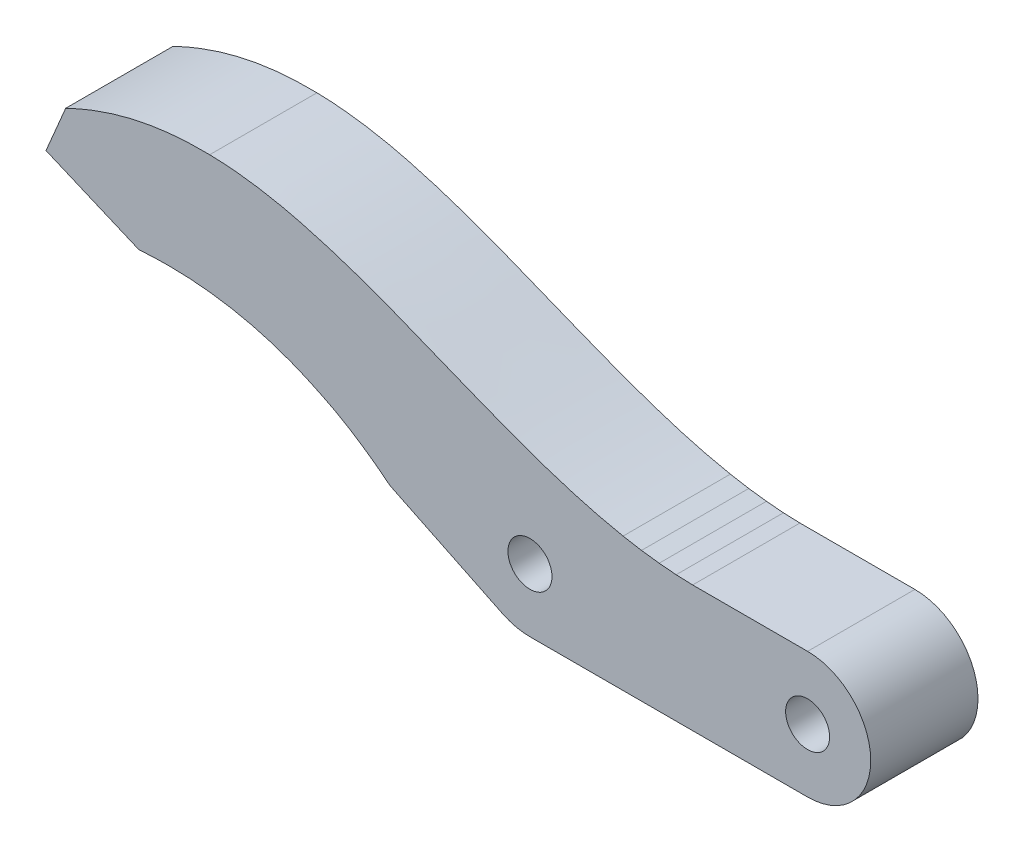
ISO-10303-21;
HEADER;
FILE_DESCRIPTION(('STEP AP214'),'2;1');
FILE_NAME('part.step','',(''),(''),'','','');
FILE_SCHEMA(('AUTOMOTIVE_DESIGN { 1 0 10303 214 1 1 1 1 }'));
ENDSEC;
DATA;
#1=APPLICATION_CONTEXT('core data for automotive mechanical design processes');
#2=APPLICATION_PROTOCOL_DEFINITION('international standard','automotive_design',2000,#1);
#3=PRODUCT_CONTEXT('',#1,'mechanical');
#4=PRODUCT('Part','Part','',(#3));
#5=PRODUCT_RELATED_PRODUCT_CATEGORY('part','',(#4));
#6=PRODUCT_DEFINITION_FORMATION('','',#4);
#7=PRODUCT_DEFINITION_CONTEXT('part definition',#1,'design');
#8=PRODUCT_DEFINITION('design','',#6,#7);
#9=PRODUCT_DEFINITION_SHAPE('','',#8);
#10=(LENGTH_UNIT() NAMED_UNIT(*) SI_UNIT(.MILLI.,.METRE.));
#11=(NAMED_UNIT(*) PLANE_ANGLE_UNIT() SI_UNIT($,.RADIAN.));
#12=(NAMED_UNIT(*) SI_UNIT($,.STERADIAN.) SOLID_ANGLE_UNIT());
#13=UNCERTAINTY_MEASURE_WITH_UNIT(LENGTH_MEASURE(1.E-05),#10,'distance_accuracy_value','');
#14=(GEOMETRIC_REPRESENTATION_CONTEXT(3) GLOBAL_UNCERTAINTY_ASSIGNED_CONTEXT((#13)) GLOBAL_UNIT_ASSIGNED_CONTEXT((#10,
#11,#12)) REPRESENTATION_CONTEXT('',''));
#15=CARTESIAN_POINT('',(0.,0.,0.));
#16=DIRECTION('',(0.,0.,1.));
#17=DIRECTION('',(1.,0.,0.));
#18=AXIS2_PLACEMENT_3D('',#15,#16,#17);
#19=CARTESIAN_POINT('',(0.,0.,8.5));
#20=DIRECTION('',(0.,0.,-1.));
#21=DIRECTION('',(-1.,0.,0.));
#22=AXIS2_PLACEMENT_3D('',#19,#20,#21);
#23=PLANE('',#22);
#24=DIRECTION('',(-1.,0.,0.));
#25=VECTOR('',#24,1.);
#26=CARTESIAN_POINT('',(-9.11,5.,8.5));
#27=LINE('',#26,#25);
#28=CARTESIAN_POINT('',(0.,5.,8.5));
#29=VERTEX_POINT('',#28);
#30=CARTESIAN_POINT('',(-9.11,5.,8.5));
#31=VERTEX_POINT('',#30);
#32=EDGE_CURVE('E57',#29,#31,#27,.T.);
#33=ORIENTED_EDGE('',*,*,#32,.T.);
#34=DIRECTION('',(-0.999267940196266,0.0382568124118017,0.));
#35=VECTOR('',#34,1.);
#36=CARTESIAN_POINT('',(-10.416,5.05,8.5));
#37=LINE('',#36,#35);
#38=CARTESIAN_POINT('',(-10.416,5.05,8.5));
#39=VERTEX_POINT('',#38);
#40=EDGE_CURVE('E137',#31,#39,#37,.T.);
#41=ORIENTED_EDGE('',*,*,#40,.T.);
#42=DIRECTION('',(-0.996312403821812,0.0857997318807208,0.));
#43=VECTOR('',#42,1.);
#44=CARTESIAN_POINT('',(-11.763,5.166,8.5));
#45=LINE('',#44,#43);
#46=CARTESIAN_POINT('',(-11.763,5.166,8.5));
#47=VERTEX_POINT('',#46);
#48=EDGE_CURVE('E371',#39,#47,#45,.T.);
#49=ORIENTED_EDGE('',*,*,#48,.T.);
#50=DIRECTION('',(-0.991812685173721,0.12770120409962,0.));
#51=VECTOR('',#50,1.);
#52=CARTESIAN_POINT('',(-13.161,5.346,8.5));
#53=LINE('',#52,#51);
#54=CARTESIAN_POINT('',(-13.161,5.346,8.5));
#55=VERTEX_POINT('',#54);
#56=EDGE_CURVE('E392',#47,#55,#53,.T.);
#57=ORIENTED_EDGE('',*,*,#56,.T.);
#58=DIRECTION('',(-0.985315590503274,0.170743044107759,0.));
#59=VECTOR('',#58,1.);
#60=CARTESIAN_POINT('',(-14.621,5.599,8.5));
#61=LINE('',#60,#59);
#62=CARTESIAN_POINT('',(-14.621,5.599,8.5));
#63=VERTEX_POINT('',#62);
#64=EDGE_CURVE('E388',#55,#63,#61,.T.);
#65=ORIENTED_EDGE('',*,*,#64,.T.);
#66=CARTESIAN_POINT('',(-14.621,5.599,8.5));
#67=CARTESIAN_POINT('',(-15.5632221305806,5.78111908355768,8.5));
#68=CARTESIAN_POINT('',(-17.0110077028515,6.12084883169998,8.5));
#69=CARTESIAN_POINT('',(-18.9894452643841,6.68473146268377,8.5));
#70=CARTESIAN_POINT('',(-20.635507848987,7.20809262616025,8.5));
#71=CARTESIAN_POINT('',(-22.4399272448679,7.83467175013059,8.5));
#72=CARTESIAN_POINT('',(-24.5401203288421,8.6199136478816,8.5));
#73=CARTESIAN_POINT('',(-27.0913973121729,9.63139633351082,8.5));
#74=CARTESIAN_POINT('',(-29.9007747495554,10.7724913339456,8.5));
#75=CARTESIAN_POINT('',(-32.5849904914353,11.8398957475534,8.5));
#76=CARTESIAN_POINT('',(-34.7946036606378,12.6654036706619,8.5));
#77=CARTESIAN_POINT('',(-36.6021823068655,13.2928353752071,8.5));
#78=CARTESIAN_POINT('',(-38.1930007961476,13.7965313566536,8.5));
#79=CARTESIAN_POINT('',(-39.6718846671477,14.2117222913425,8.5));
#80=CARTESIAN_POINT('',(-41.0683289073276,14.5763374948697,8.5));
#81=CARTESIAN_POINT('',(-42.4024631983536,14.851650390051,8.5));
#82=CARTESIAN_POINT('',(-43.6944322095685,15.0783084178799,8.5));
#83=CARTESIAN_POINT('',(-45.342048594907,15.2923375632259,8.5));
#84=CARTESIAN_POINT('',(-46.5685086449219,15.3718287736592,8.5));
#85=CARTESIAN_POINT('',(-47.3769367227312,15.389,8.5));
#86=B_SPLINE_CURVE_WITH_KNOTS('',3,(#66,#67,#68,#69,#70,#71,#72,#73,#74,#75,#76,#77,#78,#79,#80,
#81,#82,#83,#84,#85),.UNSPECIFIED.,.F.,.F.,(4,1,1,1,1,1,1,1,1,1,1,1,1,1,1,1,1,4),(0.,
0.0838344576754584,0.129855590573627,0.179713331039512,0.234726598208472,0.296726991355837,
0.375600314245061,0.474504455393492,0.56166286429517,0.627975282120287,0.68057513512632,
0.728822096790075,0.773739202764357,0.814774439219551,0.854888968830089,0.892720602723132,
0.929358166570282,1.),.UNSPECIFIED.);
#87=CARTESIAN_POINT('',(-47.3769367227312,15.389,8.5));
#88=VERTEX_POINT('',#87);
#89=EDGE_CURVE('E391',#63,#88,#86,.T.);
#90=ORIENTED_EDGE('',*,*,#89,.T.);
#91=CARTESIAN_POINT('',(-47.3769367227312,15.389,8.5));
#92=CARTESIAN_POINT('',(-48.1968920419482,15.4032911420909,8.5));
#93=CARTESIAN_POINT('',(-49.3982771214924,15.379717660922,8.5));
#94=CARTESIAN_POINT('',(-50.970775635207,15.2245588849738,8.5));
#95=CARTESIAN_POINT('',(-52.0988110612147,15.0612954478813,8.5));
#96=CARTESIAN_POINT('',(-53.2199899609859,14.8412852402432,8.5));
#97=CARTESIAN_POINT('',(-54.336112455333,14.5670081416732,8.5));
#98=CARTESIAN_POINT('',(-55.4494326003376,14.2350143387603,8.5));
#99=CARTESIAN_POINT('',(-56.9505650895382,13.7077614371698,8.5));
#100=CARTESIAN_POINT('',(-58.0560175138159,13.2269692403226,8.5));
#101=CARTESIAN_POINT('',(-58.7857741854697,12.872,8.5));
#102=B_SPLINE_CURVE_WITH_KNOTS('',3,(#91,#92,#93,#94,#95,#96,#97,#98,#99,#100,#101),
.UNSPECIFIED.,.F.,.F.,(4,1,1,1,1,1,1,1,4),(0.,0.20858067834916,0.305128650190356,
0.401665607090003,0.498317749393659,0.59556095250884,0.693826210685241,0.793634588028261,1.),.UNSPECIFIED.);
#103=CARTESIAN_POINT('',(-58.7857741854697,12.872,8.5));
#104=VERTEX_POINT('',#103);
#105=EDGE_CURVE('E396',#88,#104,#102,.T.);
#106=ORIENTED_EDGE('',*,*,#105,.T.);
#107=DIRECTION('',(-0.39002329239901,-0.920804990965099,0.));
#108=VECTOR('',#107,1.);
#109=CARTESIAN_POINT('',(-60.3457741854697,9.189,8.5));
#110=LINE('',#109,#108);
#111=CARTESIAN_POINT('',(-60.3457741854697,9.189,8.5));
#112=VERTEX_POINT('',#111);
#113=EDGE_CURVE('E512',#104,#112,#110,.T.);
#114=ORIENTED_EDGE('',*,*,#113,.T.);
#115=DIRECTION('',(0.920696148105293,-0.390280159454816,0.));
#116=VECTOR('',#115,1.);
#117=CARTESIAN_POINT('',(-60.3457741854697,9.189,8.5));
#118=LINE('',#117,#116);
#119=CARTESIAN_POINT('',(-52.9807741854697,6.067,8.5));
#120=VERTEX_POINT('',#119);
#121=EDGE_CURVE('E510',#112,#120,#118,.T.);
#122=ORIENTED_EDGE('',*,*,#121,.T.);
#123=CARTESIAN_POINT('',(-52.9807741854697,6.067,8.5));
#124=CARTESIAN_POINT('',(-51.7845129461027,6.15612312916671,8.5));
#125=CARTESIAN_POINT('',(-50.5847741854697,6.154,8.5));
#126=B_SPLINE_CURVE_WITH_KNOTS('',2,(#123,#124,#125),.UNSPECIFIED.,.F.,.F.,(3,3),(0.,1.),.UNSPECIFIED.);
#127=CARTESIAN_POINT('',(-50.5847741854697,6.154,8.5));
#128=VERTEX_POINT('',#127);
#129=EDGE_CURVE('E486',#120,#128,#126,.T.);
#130=ORIENTED_EDGE('',*,*,#129,.T.);
#131=CARTESIAN_POINT('',(-50.5847741854697,6.154,8.5));
#132=CARTESIAN_POINT('',(-49.7333072984806,6.15100313154276,8.5));
#133=CARTESIAN_POINT('',(-48.4650177731487,6.09379478021937,8.5));
#134=CARTESIAN_POINT('',(-46.7949589765816,5.90282263600254,8.5));
#135=CARTESIAN_POINT('',(-45.5715507819481,5.70700147638809,8.5));
#136=CARTESIAN_POINT('',(-44.3673679638005,5.455509833455,8.5));
#137=CARTESIAN_POINT('',(-43.1802978499257,5.15031950036537,8.5));
#138=CARTESIAN_POINT('',(-42.0097796817324,4.78962133802049,8.5));
#139=CARTESIAN_POINT('',(-40.4635840292879,4.23367480329862,8.5));
#140=CARTESIAN_POINT('',(-39.3325411238079,3.73458873020569,8.5));
#141=CARTESIAN_POINT('',(-38.5927741854696,3.367,8.5));
#142=B_SPLINE_CURVE_WITH_KNOTS('',3,(#131,#132,#133,#134,#135,#136,#137,#138,#139,#140,#141),
.UNSPECIFIED.,.F.,.F.,(4,1,1,1,1,1,1,1,4),(0.,0.205647660090695,0.306289496858727,
0.405847710612837,0.504783979544141,0.603294818644306,0.701769826113932,0.800500535398997,1.),.UNSPECIFIED.);
#143=CARTESIAN_POINT('',(-38.5927741854696,3.367,8.5));
#144=VERTEX_POINT('',#143);
#145=EDGE_CURVE('E479',#128,#144,#142,.T.);
#146=ORIENTED_EDGE('',*,*,#145,.T.);
#147=DIRECTION('',(0.892106106076966,-0.451825957089888,0.));
#148=VECTOR('',#147,1.);
#149=CARTESIAN_POINT('',(-38.5927741854696,3.367,8.5));
#150=LINE('',#149,#148);
#151=CARTESIAN_POINT('',(-37.4337741854696,2.78,8.5));
#152=VERTEX_POINT('',#151);
#153=EDGE_CURVE('E485',#144,#152,#150,.T.);
#154=ORIENTED_EDGE('',*,*,#153,.T.);
#155=DIRECTION('',(0.863097590098938,-0.505037176815139,0.));
#156=VECTOR('',#155,1.);
#157=CARTESIAN_POINT('',(-37.4337741854696,2.78,8.5));
#158=LINE('',#157,#156);
#159=CARTESIAN_POINT('',(-36.3297741854696,2.134,8.5));
#160=VERTEX_POINT('',#159);
#161=EDGE_CURVE('E496',#152,#160,#158,.T.);
#162=ORIENTED_EDGE('',*,*,#161,.T.);
#163=DIRECTION('',(0.839528977504203,-0.543314914143489,0.));
#164=VECTOR('',#163,1.);
#165=CARTESIAN_POINT('',(-36.3297741854696,2.134,8.5));
#166=LINE('',#165,#164);
#167=CARTESIAN_POINT('',(-35.2357741854696,1.426,8.5));
#168=VERTEX_POINT('',#167);
#169=EDGE_CURVE('E499',#160,#168,#166,.T.);
#170=ORIENTED_EDGE('',*,*,#169,.T.);
#171=DIRECTION('',(0.815152402391437,-0.579246545846817,0.));
#172=VECTOR('',#171,1.);
#173=CARTESIAN_POINT('',(-35.2357741854696,1.426,8.5));
#174=LINE('',#173,#172);
#175=CARTESIAN_POINT('',(-34.1507741854696,0.655,8.5));
#176=VERTEX_POINT('',#175);
#177=EDGE_CURVE('E502',#168,#176,#174,.T.);
#178=ORIENTED_EDGE('',*,*,#177,.T.);
#179=DIRECTION('',(0.789232828431673,-0.614094082796555,0.));
#180=VECTOR('',#179,1.);
#181=CARTESIAN_POINT('',(-33.0827741854696,-0.176,8.5));
#182=LINE('',#181,#180);
#183=CARTESIAN_POINT('',(-33.0827741854696,-0.176,8.5));
#184=VERTEX_POINT('',#183);
#185=EDGE_CURVE('E505',#176,#184,#182,.T.);
#186=ORIENTED_EDGE('',*,*,#185,.T.);
#187=DIRECTION('',(0.899614384537734,-0.436685194542698,0.));
#188=VECTOR('',#187,1.);
#189=CARTESIAN_POINT('',(-33.0827741854696,-0.176,8.5));
#190=LINE('',#189,#188);
#191=CARTESIAN_POINT('',(-24.1810898504688,-4.497,8.5));
#192=VERTEX_POINT('',#191);
#193=EDGE_CURVE('E193',#184,#192,#190,.T.);
#194=ORIENTED_EDGE('',*,*,#193,.T.);
#195=CARTESIAN_POINT('',(-24.1810898504688,-4.497,8.5));
#196=CARTESIAN_POINT('',(-23.8427437508329,-4.66266840572102,8.5));
#197=CARTESIAN_POINT('',(-23.1279363807985,-4.91202707093455,8.5));
#198=CARTESIAN_POINT('',(-22.3761140868882,-5.00073099476071,8.5));
#199=CARTESIAN_POINT('',(-22.,-5.,8.5));
#200=B_SPLINE_CURVE_WITH_KNOTS('',3,(#195,#196,#197,#198,#199),.UNSPECIFIED.,.F.,.F.,(4,1,4),
(0.,0.500404187456656,1.),.UNSPECIFIED.);
#201=CARTESIAN_POINT('',(-22.,-5.,8.5));
#202=VERTEX_POINT('',#201);
#203=EDGE_CURVE('E187',#192,#202,#200,.T.);
#204=ORIENTED_EDGE('',*,*,#203,.T.);
#205=DIRECTION('',(1.,0.,0.));
#206=VECTOR('',#205,1.);
#207=CARTESIAN_POINT('',(-22.,-5.,8.5));
#208=LINE('',#207,#206);
#209=CARTESIAN_POINT('',(0.,-5.,8.5));
#210=VERTEX_POINT('',#209);
#211=EDGE_CURVE('E191',#202,#210,#208,.T.);
#212=ORIENTED_EDGE('',*,*,#211,.T.);
#213=CARTESIAN_POINT('',(0.,0.,8.5));
#214=DIRECTION('',(0.,0.,1.));
#215=DIRECTION('',(-1.,0.,0.));
#216=AXIS2_PLACEMENT_3D('',#213,#214,#215);
#217=CIRCLE('',#216,5.);
#218=EDGE_CURVE('E210',#210,#29,#217,.T.);
#219=ORIENTED_EDGE('',*,*,#218,.T.);
#220=EDGE_LOOP('',(#33,#41,#49,#57,#65,#90,#106,#114,#122,#130,#146,#154,#162,#170,#178,#186,
#194,#204,#212,#219));
#221=FACE_BOUND('',#220,.T.);
#222=CARTESIAN_POINT('',(0.,0.,8.5));
#223=DIRECTION('',(0.,0.,1.));
#224=DIRECTION('',(1.,0.,0.));
#225=AXIS2_PLACEMENT_3D('',#222,#223,#224);
#226=CIRCLE('',#225,1.743);
#227=CARTESIAN_POINT('',(1.743,0.,8.5));
#228=VERTEX_POINT('',#227);
#229=EDGE_CURVE('E224',#228,#228,#226,.T.);
#230=ORIENTED_EDGE('',*,*,#229,.F.);
#231=EDGE_LOOP('',(#230));
#232=FACE_BOUND('',#231,.T.);
#233=CARTESIAN_POINT('',(-22.,0.,8.5));
#234=DIRECTION('',(0.,0.,1.));
#235=DIRECTION('',(1.,0.,0.));
#236=AXIS2_PLACEMENT_3D('',#233,#234,#235);
#237=CIRCLE('',#236,1.745);
#238=CARTESIAN_POINT('',(-20.255,0.,8.5));
#239=VERTEX_POINT('',#238);
#240=EDGE_CURVE('E562',#239,#239,#237,.T.);
#241=ORIENTED_EDGE('',*,*,#240,.F.);
#242=EDGE_LOOP('',(#241));
#243=FACE_BOUND('',#242,.T.);
#244=ADVANCED_FACE('F39',(#221,#232,#243),#23,.F.);
#245=CARTESIAN_POINT('',(0.,0.,0.));
#246=DIRECTION('',(0.,0.,-1.));
#247=DIRECTION('',(-1.,0.,0.));
#248=AXIS2_PLACEMENT_3D('',#245,#246,#247);
#249=PLANE('',#248);
#250=CARTESIAN_POINT('',(0.,0.,0.));
#251=DIRECTION('',(0.,0.,1.));
#252=DIRECTION('',(1.,0.,0.));
#253=AXIS2_PLACEMENT_3D('',#250,#251,#252);
#254=CIRCLE('',#253,1.743);
#255=CARTESIAN_POINT('',(1.743,0.,0.));
#256=VERTEX_POINT('',#255);
#257=EDGE_CURVE('E557',#256,#256,#254,.T.);
#258=ORIENTED_EDGE('',*,*,#257,.T.);
#259=EDGE_LOOP('',(#258));
#260=FACE_BOUND('',#259,.T.);
#261=DIRECTION('',(-0.999267940196266,0.0382568124118017,0.));
#262=VECTOR('',#261,1.);
#263=CARTESIAN_POINT('',(-10.416,5.05,0.));
#264=LINE('',#263,#262);
#265=CARTESIAN_POINT('',(-9.11,5.,0.));
#266=VERTEX_POINT('',#265);
#267=CARTESIAN_POINT('',(-10.416,5.05,0.));
#268=VERTEX_POINT('',#267);
#269=EDGE_CURVE('E220',#266,#268,#264,.T.);
#270=ORIENTED_EDGE('',*,*,#269,.F.);
#271=DIRECTION('',(-1.,0.,0.));
#272=VECTOR('',#271,1.);
#273=CARTESIAN_POINT('',(-8.694,5.,0.));
#274=LINE('',#273,#272);
#275=CARTESIAN_POINT('',(0.,5.,0.));
#276=VERTEX_POINT('',#275);
#277=EDGE_CURVE('E300',#276,#266,#274,.T.);
#278=ORIENTED_EDGE('',*,*,#277,.F.);
#279=CARTESIAN_POINT('',(0.,0.,0.));
#280=DIRECTION('',(0.,0.,1.));
#281=DIRECTION('',(-1.,0.,0.));
#282=AXIS2_PLACEMENT_3D('',#279,#280,#281);
#283=CIRCLE('',#282,5.);
#284=CARTESIAN_POINT('',(0.,-5.,0.));
#285=VERTEX_POINT('',#284);
#286=EDGE_CURVE('E130',#285,#276,#283,.T.);
#287=ORIENTED_EDGE('',*,*,#286,.F.);
#288=DIRECTION('',(1.,0.,0.));
#289=VECTOR('',#288,1.);
#290=CARTESIAN_POINT('',(-22.,-5.,0.));
#291=LINE('',#290,#289);
#292=CARTESIAN_POINT('',(-22.,-5.,0.));
#293=VERTEX_POINT('',#292);
#294=EDGE_CURVE('E123',#293,#285,#291,.T.);
#295=ORIENTED_EDGE('',*,*,#294,.F.);
#296=CARTESIAN_POINT('',(-24.1810898504688,-4.497,0.));
#297=CARTESIAN_POINT('',(-23.8427437508329,-4.66266840572102,0.));
#298=CARTESIAN_POINT('',(-23.1279363807985,-4.91202707093455,0.));
#299=CARTESIAN_POINT('',(-22.3761140868882,-5.00073099476071,0.));
#300=CARTESIAN_POINT('',(-22.,-5.,0.));
#301=B_SPLINE_CURVE_WITH_KNOTS('',3,(#296,#297,#298,#299,#300),.UNSPECIFIED.,.F.,.F.,(4,1,4),
(0.,0.500404187456656,1.),.UNSPECIFIED.);
#302=CARTESIAN_POINT('',(-24.1810898504688,-4.497,0.));
#303=VERTEX_POINT('',#302);
#304=EDGE_CURVE('E202',#303,#293,#301,.T.);
#305=ORIENTED_EDGE('',*,*,#304,.F.);
#306=DIRECTION('',(0.899614384537734,-0.436685194542698,0.));
#307=VECTOR('',#306,1.);
#308=CARTESIAN_POINT('',(-33.0827741854696,-0.176,0.));
#309=LINE('',#308,#307);
#310=CARTESIAN_POINT('',(-33.0827741854696,-0.176,0.));
#311=VERTEX_POINT('',#310);
#312=EDGE_CURVE('E286',#311,#303,#309,.T.);
#313=ORIENTED_EDGE('',*,*,#312,.F.);
#314=DIRECTION('',(0.789232828431673,-0.614094082796555,0.));
#315=VECTOR('',#314,1.);
#316=CARTESIAN_POINT('',(-33.0827741854696,-0.176,0.));
#317=LINE('',#316,#315);
#318=CARTESIAN_POINT('',(-34.1507741854696,0.655,0.));
#319=VERTEX_POINT('',#318);
#320=EDGE_CURVE('E283',#319,#311,#317,.T.);
#321=ORIENTED_EDGE('',*,*,#320,.F.);
#322=DIRECTION('',(0.815152402391437,-0.579246545846817,0.));
#323=VECTOR('',#322,1.);
#324=CARTESIAN_POINT('',(-35.2357741854696,1.426,0.));
#325=LINE('',#324,#323);
#326=CARTESIAN_POINT('',(-35.2357741854696,1.426,0.));
#327=VERTEX_POINT('',#326);
#328=EDGE_CURVE('E280',#327,#319,#325,.T.);
#329=ORIENTED_EDGE('',*,*,#328,.F.);
#330=DIRECTION('',(0.839528977504203,-0.543314914143489,0.));
#331=VECTOR('',#330,1.);
#332=CARTESIAN_POINT('',(-36.3297741854696,2.134,0.));
#333=LINE('',#332,#331);
#334=CARTESIAN_POINT('',(-36.3297741854696,2.134,0.));
#335=VERTEX_POINT('',#334);
#336=EDGE_CURVE('E277',#335,#327,#333,.T.);
#337=ORIENTED_EDGE('',*,*,#336,.F.);
#338=DIRECTION('',(0.863097590098938,-0.505037176815139,0.));
#339=VECTOR('',#338,1.);
#340=CARTESIAN_POINT('',(-37.4337741854696,2.78,0.));
#341=LINE('',#340,#339);
#342=CARTESIAN_POINT('',(-37.4337741854696,2.78,0.));
#343=VERTEX_POINT('',#342);
#344=EDGE_CURVE('E274',#343,#335,#341,.T.);
#345=ORIENTED_EDGE('',*,*,#344,.F.);
#346=DIRECTION('',(0.892106106076966,-0.451825957089888,0.));
#347=VECTOR('',#346,1.);
#348=CARTESIAN_POINT('',(-38.5927741854696,3.367,0.));
#349=LINE('',#348,#347);
#350=CARTESIAN_POINT('',(-38.5927741854696,3.367,0.));
#351=VERTEX_POINT('',#350);
#352=EDGE_CURVE('E268',#351,#343,#349,.T.);
#353=ORIENTED_EDGE('',*,*,#352,.F.);
#354=CARTESIAN_POINT('',(-50.5847741854697,6.154,0.));
#355=CARTESIAN_POINT('',(-49.7333072984806,6.15100313154276,0.));
#356=CARTESIAN_POINT('',(-48.4650177731487,6.09379478021937,0.));
#357=CARTESIAN_POINT('',(-46.7949589765816,5.90282263600254,0.));
#358=CARTESIAN_POINT('',(-45.5715507819481,5.70700147638809,0.));
#359=CARTESIAN_POINT('',(-44.3673679638005,5.455509833455,0.));
#360=CARTESIAN_POINT('',(-43.1802978499257,5.15031950036537,0.));
#361=CARTESIAN_POINT('',(-42.0097796817324,4.78962133802049,0.));
#362=CARTESIAN_POINT('',(-40.4635840292879,4.23367480329862,0.));
#363=CARTESIAN_POINT('',(-39.3325411238079,3.73458873020569,0.));
#364=CARTESIAN_POINT('',(-38.5927741854696,3.367,0.));
#365=B_SPLINE_CURVE_WITH_KNOTS('',3,(#354,#355,#356,#357,#358,#359,#360,#361,#362,#363,#364),
.UNSPECIFIED.,.F.,.F.,(4,1,1,1,1,1,1,1,4),(0.,0.205647660090695,0.306289496858727,
0.405847710612837,0.504783979544141,0.603294818644306,0.701769826113932,0.800500535398997,1.),.UNSPECIFIED.);
#366=CARTESIAN_POINT('',(-50.5847741854697,6.154,0.));
#367=VERTEX_POINT('',#366);
#368=EDGE_CURVE('E260',#367,#351,#365,.T.);
#369=ORIENTED_EDGE('',*,*,#368,.F.);
#370=CARTESIAN_POINT('',(-52.9807741854697,6.067,0.));
#371=CARTESIAN_POINT('',(-51.7845129461027,6.15612312916671,0.));
#372=CARTESIAN_POINT('',(-50.5847741854697,6.154,0.));
#373=B_SPLINE_CURVE_WITH_KNOTS('',2,(#370,#371,#372),.UNSPECIFIED.,.F.,.F.,(3,3),(0.,1.),.UNSPECIFIED.);
#374=CARTESIAN_POINT('',(-52.9807741854697,6.067,0.));
#375=VERTEX_POINT('',#374);
#376=EDGE_CURVE('E255',#375,#367,#373,.T.);
#377=ORIENTED_EDGE('',*,*,#376,.F.);
#378=DIRECTION('',(0.920696148105293,-0.390280159454816,0.));
#379=VECTOR('',#378,1.);
#380=CARTESIAN_POINT('',(-60.3457741854697,9.189,0.));
#381=LINE('',#380,#379);
#382=CARTESIAN_POINT('',(-60.3457741854697,9.189,0.));
#383=VERTEX_POINT('',#382);
#384=EDGE_CURVE('E252',#383,#375,#381,.T.);
#385=ORIENTED_EDGE('',*,*,#384,.F.);
#386=DIRECTION('',(-0.39002329239901,-0.920804990965099,0.));
#387=VECTOR('',#386,1.);
#388=CARTESIAN_POINT('',(-60.3457741854697,9.189,0.));
#389=LINE('',#388,#387);
#390=CARTESIAN_POINT('',(-58.7857741854697,12.872,0.));
#391=VERTEX_POINT('',#390);
#392=EDGE_CURVE('E246',#391,#383,#389,.T.);
#393=ORIENTED_EDGE('',*,*,#392,.F.);
#394=CARTESIAN_POINT('',(-47.3769367227312,15.389,0.));
#395=CARTESIAN_POINT('',(-48.1968920419482,15.4032911420909,0.));
#396=CARTESIAN_POINT('',(-49.3982771214924,15.379717660922,0.));
#397=CARTESIAN_POINT('',(-50.970775635207,15.2245588849738,0.));
#398=CARTESIAN_POINT('',(-52.0988110612147,15.0612954478813,0.));
#399=CARTESIAN_POINT('',(-53.2199899609859,14.8412852402432,0.));
#400=CARTESIAN_POINT('',(-54.336112455333,14.5670081416732,0.));
#401=CARTESIAN_POINT('',(-55.4494326003376,14.2350143387603,0.));
#402=CARTESIAN_POINT('',(-56.9505650895382,13.7077614371698,0.));
#403=CARTESIAN_POINT('',(-58.0560175138159,13.2269692403226,0.));
#404=CARTESIAN_POINT('',(-58.7857741854697,12.872,0.));
#405=B_SPLINE_CURVE_WITH_KNOTS('',3,(#394,#395,#396,#397,#398,#399,#400,#401,#402,#403,#404),
.UNSPECIFIED.,.F.,.F.,(4,1,1,1,1,1,1,1,4),(0.,0.20858067834916,0.305128650190356,
0.401665607090003,0.498317749393659,0.59556095250884,0.693826210685241,0.793634588028261,1.),.UNSPECIFIED.);
#406=CARTESIAN_POINT('',(-47.3769367227312,15.389,0.));
#407=VERTEX_POINT('',#406);
#408=EDGE_CURVE('E238',#407,#391,#405,.T.);
#409=ORIENTED_EDGE('',*,*,#408,.F.);
#410=CARTESIAN_POINT('',(-14.621,5.599,0.));
#411=CARTESIAN_POINT('',(-15.5632221305806,5.78111908355768,0.));
#412=CARTESIAN_POINT('',(-17.0110077028515,6.12084883169998,0.));
#413=CARTESIAN_POINT('',(-18.9894452643841,6.68473146268377,0.));
#414=CARTESIAN_POINT('',(-20.635507848987,7.20809262616025,0.));
#415=CARTESIAN_POINT('',(-22.4399272448679,7.83467175013059,0.));
#416=CARTESIAN_POINT('',(-24.5401203288421,8.6199136478816,0.));
#417=CARTESIAN_POINT('',(-27.0913973121729,9.63139633351082,0.));
#418=CARTESIAN_POINT('',(-29.9007747495554,10.7724913339456,0.));
#419=CARTESIAN_POINT('',(-32.5849904914353,11.8398957475534,0.));
#420=CARTESIAN_POINT('',(-34.7946036606378,12.6654036706619,0.));
#421=CARTESIAN_POINT('',(-36.6021823068655,13.2928353752071,0.));
#422=CARTESIAN_POINT('',(-38.1930007961476,13.7965313566536,0.));
#423=CARTESIAN_POINT('',(-39.6718846671477,14.2117222913425,0.));
#424=CARTESIAN_POINT('',(-41.0683289073276,14.5763374948697,0.));
#425=CARTESIAN_POINT('',(-42.4024631983536,14.851650390051,0.));
#426=CARTESIAN_POINT('',(-43.6944322095685,15.0783084178799,0.));
#427=CARTESIAN_POINT('',(-45.342048594907,15.2923375632259,0.));
#428=CARTESIAN_POINT('',(-46.5685086449219,15.3718287736592,0.));
#429=CARTESIAN_POINT('',(-47.3769367227312,15.389,0.));
#430=B_SPLINE_CURVE_WITH_KNOTS('',3,(#410,#411,#412,#413,#414,#415,#416,#417,#418,#419,#420,
#421,#422,#423,#424,#425,#426,#427,#428,#429),.UNSPECIFIED.,.F.,.F.,(4,1,1,1,1,1,1,1,1,1,1,1,1,
1,1,1,1,4),(0.,0.0838344576754584,0.129855590573627,0.179713331039512,0.234726598208472,
0.296726991355837,0.375600314245061,0.474504455393492,0.56166286429517,0.627975282120287,
0.68057513512632,0.728822096790075,0.773739202764357,0.814774439219551,0.854888968830089,
0.892720602723132,0.929358166570282,1.),.UNSPECIFIED.);
#431=CARTESIAN_POINT('',(-14.621,5.599,0.));
#432=VERTEX_POINT('',#431);
#433=EDGE_CURVE('E233',#432,#407,#430,.T.);
#434=ORIENTED_EDGE('',*,*,#433,.F.);
#435=DIRECTION('',(-0.985315590503274,0.170743044107759,0.));
#436=VECTOR('',#435,1.);
#437=CARTESIAN_POINT('',(-14.621,5.599,0.));
#438=LINE('',#437,#436);
#439=CARTESIAN_POINT('',(-13.161,5.346,0.));
#440=VERTEX_POINT('',#439);
#441=EDGE_CURVE('E230',#440,#432,#438,.T.);
#442=ORIENTED_EDGE('',*,*,#441,.F.);
#443=DIRECTION('',(-0.991812685173721,0.12770120409962,0.));
#444=VECTOR('',#443,1.);
#445=CARTESIAN_POINT('',(-13.161,5.346,0.));
#446=LINE('',#445,#444);
#447=CARTESIAN_POINT('',(-11.763,5.166,0.));
#448=VERTEX_POINT('',#447);
#449=EDGE_CURVE('E227',#448,#440,#446,.T.);
#450=ORIENTED_EDGE('',*,*,#449,.F.);
#451=DIRECTION('',(-0.996312403821812,0.0857997318807208,0.));
#452=VECTOR('',#451,1.);
#453=CARTESIAN_POINT('',(-11.763,5.166,0.));
#454=LINE('',#453,#452);
#455=EDGE_CURVE('E223',#268,#448,#454,.T.);
#456=ORIENTED_EDGE('',*,*,#455,.F.);
#457=EDGE_LOOP('',(#270,#278,#287,#295,#305,#313,#321,#329,#337,#345,#353,#369,#377,#385,#393,
#409,#434,#442,#450,#456));
#458=FACE_BOUND('',#457,.T.);
#459=CARTESIAN_POINT('',(-22.,0.,0.));
#460=DIRECTION('',(0.,0.,1.));
#461=DIRECTION('',(1.,0.,0.));
#462=AXIS2_PLACEMENT_3D('',#459,#460,#461);
#463=CIRCLE('',#462,1.745);
#464=CARTESIAN_POINT('',(-20.255,0.,0.));
#465=VERTEX_POINT('',#464);
#466=EDGE_CURVE('E566',#465,#465,#463,.T.);
#467=ORIENTED_EDGE('',*,*,#466,.T.);
#468=EDGE_LOOP('',(#467));
#469=FACE_BOUND('',#468,.T.);
#470=ADVANCED_FACE('F375',(#260,#458,#469),#249,.T.);
#471=CARTESIAN_POINT('',(-10.416,5.05,8.5));
#472=DIRECTION('',(-0.0382568124118017,-0.999267940196266,0.));
#473=DIRECTION('',(0.999267940196266,-0.0382568124118017,0.));
#474=AXIS2_PLACEMENT_3D('',#471,#472,#473);
#475=PLANE('',#474);
#476=ORIENTED_EDGE('',*,*,#269,.T.);
#477=DIRECTION('',(0.,0.,-1.));
#478=VECTOR('',#477,1.);
#479=CARTESIAN_POINT('',(-10.416,5.05,8.5));
#480=LINE('',#479,#478);
#481=EDGE_CURVE('E49',#39,#268,#480,.T.);
#482=ORIENTED_EDGE('',*,*,#481,.F.);
#483=ORIENTED_EDGE('',*,*,#40,.F.);
#484=DIRECTION('',(0.,0.,-1.));
#485=VECTOR('',#484,1.);
#486=CARTESIAN_POINT('',(-9.11,5.,8.5));
#487=LINE('',#486,#485);
#488=EDGE_CURVE('E11',#31,#266,#487,.T.);
#489=ORIENTED_EDGE('',*,*,#488,.T.);
#490=EDGE_LOOP('',(#476,#482,#483,#489));
#491=FACE_BOUND('',#490,.T.);
#492=ADVANCED_FACE('F41',(#491),#475,.F.);
#493=CARTESIAN_POINT('',(-11.763,5.166,8.5));
#494=DIRECTION('',(-0.0857997318807208,-0.996312403821812,0.));
#495=DIRECTION('',(0.996312403821812,-0.0857997318807208,0.));
#496=AXIS2_PLACEMENT_3D('',#493,#494,#495);
#497=PLANE('',#496);
#498=ORIENTED_EDGE('',*,*,#455,.T.);
#499=DIRECTION('',(0.,0.,-1.));
#500=VECTOR('',#499,1.);
#501=CARTESIAN_POINT('',(-11.763,5.166,8.5));
#502=LINE('',#501,#500);
#503=EDGE_CURVE('E361',#47,#448,#502,.T.);
#504=ORIENTED_EDGE('',*,*,#503,.F.);
#505=ORIENTED_EDGE('',*,*,#48,.F.);
#506=ORIENTED_EDGE('',*,*,#481,.T.);
#507=EDGE_LOOP('',(#498,#504,#505,#506));
#508=FACE_BOUND('',#507,.T.);
#509=ADVANCED_FACE('F369',(#508),#497,.F.);
#510=CARTESIAN_POINT('',(-13.161,5.346,8.5));
#511=DIRECTION('',(-0.127701204099621,-0.991812685173721,0.));
#512=DIRECTION('',(0.991812685173721,-0.12770120409962,0.));
#513=AXIS2_PLACEMENT_3D('',#510,#511,#512);
#514=PLANE('',#513);
#515=ORIENTED_EDGE('',*,*,#449,.T.);
#516=DIRECTION('',(0.,0.,-1.));
#517=VECTOR('',#516,1.);
#518=CARTESIAN_POINT('',(-13.161,5.346,8.5));
#519=LINE('',#518,#517);
#520=EDGE_CURVE('E357',#55,#440,#519,.T.);
#521=ORIENTED_EDGE('',*,*,#520,.F.);
#522=ORIENTED_EDGE('',*,*,#56,.F.);
#523=ORIENTED_EDGE('',*,*,#503,.T.);
#524=EDGE_LOOP('',(#515,#521,#522,#523));
#525=FACE_BOUND('',#524,.T.);
#526=ADVANCED_FACE('F382',(#525),#514,.F.);
#527=CARTESIAN_POINT('',(-14.621,5.599,8.5));
#528=DIRECTION('',(-0.170743044107759,-0.985315590503274,0.));
#529=DIRECTION('',(0.985315590503274,-0.170743044107759,0.));
#530=AXIS2_PLACEMENT_3D('',#527,#528,#529);
#531=PLANE('',#530);
#532=ORIENTED_EDGE('',*,*,#441,.T.);
#533=DIRECTION('',(0.,0.,-1.));
#534=VECTOR('',#533,1.);
#535=CARTESIAN_POINT('',(-14.621,5.599,8.5));
#536=LINE('',#535,#534);
#537=EDGE_CURVE('E353',#63,#432,#536,.T.);
#538=ORIENTED_EDGE('',*,*,#537,.F.);
#539=ORIENTED_EDGE('',*,*,#64,.F.);
#540=ORIENTED_EDGE('',*,*,#520,.T.);
#541=EDGE_LOOP('',(#532,#538,#539,#540));
#542=FACE_BOUND('',#541,.T.);
#543=ADVANCED_FACE('F386',(#542),#531,.F.);
#544=DIRECTION('',(0.,0.,-1.));
#545=VECTOR('',#544,1.);
#546=SURFACE_OF_LINEAR_EXTRUSION('',#86,#545);
#547=ORIENTED_EDGE('',*,*,#433,.T.);
#548=DIRECTION('',(0.,0.,-1.));
#549=VECTOR('',#548,1.);
#550=CARTESIAN_POINT('',(-47.3769367227312,15.389,8.5));
#551=LINE('',#550,#549);
#552=EDGE_CURVE('E349',#88,#407,#551,.T.);
#553=ORIENTED_EDGE('',*,*,#552,.F.);
#554=ORIENTED_EDGE('',*,*,#89,.F.);
#555=ORIENTED_EDGE('',*,*,#537,.T.);
#556=EDGE_LOOP('',(#547,#553,#554,#555));
#557=FACE_BOUND('',#556,.T.);
#558=ADVANCED_FACE('F412',(#557),#546,.F.);
#559=DIRECTION('',(0.,0.,-1.));
#560=VECTOR('',#559,1.);
#561=SURFACE_OF_LINEAR_EXTRUSION('',#102,#560);
#562=ORIENTED_EDGE('',*,*,#408,.T.);
#563=DIRECTION('',(0.,0.,-1.));
#564=VECTOR('',#563,1.);
#565=CARTESIAN_POINT('',(-58.7857741854697,12.872,8.5));
#566=LINE('',#565,#564);
#567=EDGE_CURVE('E345',#104,#391,#566,.T.);
#568=ORIENTED_EDGE('',*,*,#567,.F.);
#569=ORIENTED_EDGE('',*,*,#105,.F.);
#570=ORIENTED_EDGE('',*,*,#552,.T.);
#571=EDGE_LOOP('',(#562,#568,#569,#570));
#572=FACE_BOUND('',#571,.T.);
#573=ADVANCED_FACE('F416',(#572),#561,.F.);
#574=CARTESIAN_POINT('',(-60.3457741854697,9.189,8.5));
#575=DIRECTION('',(0.920804990965099,-0.39002329239901,0.));
#576=DIRECTION('',(0.39002329239901,0.920804990965099,0.));
#577=AXIS2_PLACEMENT_3D('',#574,#575,#576);
#578=PLANE('',#577);
#579=ORIENTED_EDGE('',*,*,#392,.T.);
#580=DIRECTION('',(0.,0.,-1.));
#581=VECTOR('',#580,1.);
#582=CARTESIAN_POINT('',(-60.3457741854697,9.189,8.5));
#583=LINE('',#582,#581);
#584=EDGE_CURVE('E341',#112,#383,#583,.T.);
#585=ORIENTED_EDGE('',*,*,#584,.F.);
#586=ORIENTED_EDGE('',*,*,#113,.F.);
#587=ORIENTED_EDGE('',*,*,#567,.T.);
#588=EDGE_LOOP('',(#579,#585,#586,#587));
#589=FACE_BOUND('',#588,.T.);
#590=ADVANCED_FACE('F523',(#589),#578,.F.);
#591=CARTESIAN_POINT('',(-60.3457741854697,9.189,8.5));
#592=DIRECTION('',(0.390280159454816,0.920696148105293,0.));
#593=DIRECTION('',(-0.920696148105293,0.390280159454816,0.));
#594=AXIS2_PLACEMENT_3D('',#591,#592,#593);
#595=PLANE('',#594);
#596=ORIENTED_EDGE('',*,*,#384,.T.);
#597=DIRECTION('',(0.,0.,-1.));
#598=VECTOR('',#597,1.);
#599=CARTESIAN_POINT('',(-52.9807741854697,6.067,8.5));
#600=LINE('',#599,#598);
#601=EDGE_CURVE('E337',#120,#375,#600,.T.);
#602=ORIENTED_EDGE('',*,*,#601,.F.);
#603=ORIENTED_EDGE('',*,*,#121,.F.);
#604=ORIENTED_EDGE('',*,*,#584,.T.);
#605=EDGE_LOOP('',(#596,#602,#603,#604));
#606=FACE_BOUND('',#605,.T.);
#607=ADVANCED_FACE('F528',(#606),#595,.F.);
#608=DIRECTION('',(0.,0.,-1.));
#609=VECTOR('',#608,1.);
#610=SURFACE_OF_LINEAR_EXTRUSION('',#126,#609);
#611=ORIENTED_EDGE('',*,*,#376,.T.);
#612=DIRECTION('',(0.,0.,-1.));
#613=VECTOR('',#612,1.);
#614=CARTESIAN_POINT('',(-50.5847741854697,6.154,8.5));
#615=LINE('',#614,#613);
#616=EDGE_CURVE('E333',#128,#367,#615,.T.);
#617=ORIENTED_EDGE('',*,*,#616,.F.);
#618=ORIENTED_EDGE('',*,*,#129,.F.);
#619=ORIENTED_EDGE('',*,*,#601,.T.);
#620=EDGE_LOOP('',(#611,#617,#618,#619));
#621=FACE_BOUND('',#620,.T.);
#622=ADVANCED_FACE('F475',(#621),#610,.F.);
#623=DIRECTION('',(0.,0.,-1.));
#624=VECTOR('',#623,1.);
#625=SURFACE_OF_LINEAR_EXTRUSION('',#142,#624);
#626=ORIENTED_EDGE('',*,*,#368,.T.);
#627=DIRECTION('',(0.,0.,-1.));
#628=VECTOR('',#627,1.);
#629=CARTESIAN_POINT('',(-38.5927741854696,3.367,8.5));
#630=LINE('',#629,#628);
#631=EDGE_CURVE('E329',#144,#351,#630,.T.);
#632=ORIENTED_EDGE('',*,*,#631,.F.);
#633=ORIENTED_EDGE('',*,*,#145,.F.);
#634=ORIENTED_EDGE('',*,*,#616,.T.);
#635=EDGE_LOOP('',(#626,#632,#633,#634));
#636=FACE_BOUND('',#635,.T.);
#637=ADVANCED_FACE('F470',(#636),#625,.F.);
#638=CARTESIAN_POINT('',(-38.5927741854696,3.367,8.5));
#639=DIRECTION('',(0.451825957089888,0.892106106076966,0.));
#640=DIRECTION('',(-0.892106106076966,0.451825957089888,0.));
#641=AXIS2_PLACEMENT_3D('',#638,#639,#640);
#642=PLANE('',#641);
#643=ORIENTED_EDGE('',*,*,#352,.T.);
#644=DIRECTION('',(0.,0.,-1.));
#645=VECTOR('',#644,1.);
#646=CARTESIAN_POINT('',(-37.4337741854696,2.78,8.5));
#647=LINE('',#646,#645);
#648=EDGE_CURVE('E325',#152,#343,#647,.T.);
#649=ORIENTED_EDGE('',*,*,#648,.F.);
#650=ORIENTED_EDGE('',*,*,#153,.F.);
#651=ORIENTED_EDGE('',*,*,#631,.T.);
#652=EDGE_LOOP('',(#643,#649,#650,#651));
#653=FACE_BOUND('',#652,.T.);
#654=ADVANCED_FACE('F466',(#653),#642,.F.);
#655=CARTESIAN_POINT('',(-37.4337741854696,2.78,8.5));
#656=DIRECTION('',(0.505037176815139,0.863097590098938,0.));
#657=DIRECTION('',(-0.863097590098938,0.505037176815139,0.));
#658=AXIS2_PLACEMENT_3D('',#655,#656,#657);
#659=PLANE('',#658);
#660=ORIENTED_EDGE('',*,*,#344,.T.);
#661=DIRECTION('',(0.,0.,-1.));
#662=VECTOR('',#661,1.);
#663=CARTESIAN_POINT('',(-36.3297741854696,2.134,8.5));
#664=LINE('',#663,#662);
#665=EDGE_CURVE('E321',#160,#335,#664,.T.);
#666=ORIENTED_EDGE('',*,*,#665,.F.);
#667=ORIENTED_EDGE('',*,*,#161,.F.);
#668=ORIENTED_EDGE('',*,*,#648,.T.);
#669=EDGE_LOOP('',(#660,#666,#667,#668));
#670=FACE_BOUND('',#669,.T.);
#671=ADVANCED_FACE('F462',(#670),#659,.F.);
#672=CARTESIAN_POINT('',(-36.3297741854696,2.134,8.5));
#673=DIRECTION('',(0.543314914143489,0.839528977504203,0.));
#674=DIRECTION('',(-0.839528977504203,0.543314914143489,0.));
#675=AXIS2_PLACEMENT_3D('',#672,#673,#674);
#676=PLANE('',#675);
#677=ORIENTED_EDGE('',*,*,#336,.T.);
#678=DIRECTION('',(0.,0.,-1.));
#679=VECTOR('',#678,1.);
#680=CARTESIAN_POINT('',(-35.2357741854696,1.426,8.5));
#681=LINE('',#680,#679);
#682=EDGE_CURVE('E317',#168,#327,#681,.T.);
#683=ORIENTED_EDGE('',*,*,#682,.F.);
#684=ORIENTED_EDGE('',*,*,#169,.F.);
#685=ORIENTED_EDGE('',*,*,#665,.T.);
#686=EDGE_LOOP('',(#677,#683,#684,#685));
#687=FACE_BOUND('',#686,.T.);
#688=ADVANCED_FACE('F458',(#687),#676,.F.);
#689=CARTESIAN_POINT('',(-35.2357741854696,1.426,8.5));
#690=DIRECTION('',(0.579246545846817,0.815152402391437,0.));
#691=DIRECTION('',(-0.815152402391437,0.579246545846817,0.));
#692=AXIS2_PLACEMENT_3D('',#689,#690,#691);
#693=PLANE('',#692);
#694=ORIENTED_EDGE('',*,*,#328,.T.);
#695=DIRECTION('',(0.,0.,-1.));
#696=VECTOR('',#695,1.);
#697=CARTESIAN_POINT('',(-34.1507741854696,0.655,8.5));
#698=LINE('',#697,#696);
#699=EDGE_CURVE('E313',#176,#319,#698,.T.);
#700=ORIENTED_EDGE('',*,*,#699,.F.);
#701=ORIENTED_EDGE('',*,*,#177,.F.);
#702=ORIENTED_EDGE('',*,*,#682,.T.);
#703=EDGE_LOOP('',(#694,#700,#701,#702));
#704=FACE_BOUND('',#703,.T.);
#705=ADVANCED_FACE('F454',(#704),#693,.F.);
#706=CARTESIAN_POINT('',(-33.0827741854696,-0.176,8.5));
#707=DIRECTION('',(0.614094082796555,0.789232828431673,0.));
#708=DIRECTION('',(-0.789232828431673,0.614094082796555,0.));
#709=AXIS2_PLACEMENT_3D('',#706,#707,#708);
#710=PLANE('',#709);
#711=ORIENTED_EDGE('',*,*,#320,.T.);
#712=DIRECTION('',(0.,0.,-1.));
#713=VECTOR('',#712,1.);
#714=CARTESIAN_POINT('',(-33.0827741854696,-0.176,8.5));
#715=LINE('',#714,#713);
#716=EDGE_CURVE('E309',#184,#311,#715,.T.);
#717=ORIENTED_EDGE('',*,*,#716,.F.);
#718=ORIENTED_EDGE('',*,*,#185,.F.);
#719=ORIENTED_EDGE('',*,*,#699,.T.);
#720=EDGE_LOOP('',(#711,#717,#718,#719));
#721=FACE_BOUND('',#720,.T.);
#722=ADVANCED_FACE('F450',(#721),#710,.F.);
#723=CARTESIAN_POINT('',(-33.0827741854696,-0.176,8.5));
#724=DIRECTION('',(0.436685194542699,0.899614384537734,0.));
#725=DIRECTION('',(-0.899614384537734,0.436685194542698,0.));
#726=AXIS2_PLACEMENT_3D('',#723,#724,#725);
#727=PLANE('',#726);
#728=ORIENTED_EDGE('',*,*,#312,.T.);
#729=DIRECTION('',(0.,0.,-1.));
#730=VECTOR('',#729,1.);
#731=CARTESIAN_POINT('',(-24.1810898504688,-4.497,8.5));
#732=LINE('',#731,#730);
#733=EDGE_CURVE('E204',#192,#303,#732,.T.);
#734=ORIENTED_EDGE('',*,*,#733,.F.);
#735=ORIENTED_EDGE('',*,*,#193,.F.);
#736=ORIENTED_EDGE('',*,*,#716,.T.);
#737=EDGE_LOOP('',(#728,#734,#735,#736));
#738=FACE_BOUND('',#737,.T.);
#739=ADVANCED_FACE('F447',(#738),#727,.F.);
#740=DIRECTION('',(0.,0.,-1.));
#741=VECTOR('',#740,1.);
#742=SURFACE_OF_LINEAR_EXTRUSION('',#200,#741);
#743=ORIENTED_EDGE('',*,*,#304,.T.);
#744=DIRECTION('',(0.,0.,-1.));
#745=VECTOR('',#744,1.);
#746=CARTESIAN_POINT('',(-22.,-5.,8.5));
#747=LINE('',#746,#745);
#748=EDGE_CURVE('E199',#202,#293,#747,.T.);
#749=ORIENTED_EDGE('',*,*,#748,.F.);
#750=ORIENTED_EDGE('',*,*,#203,.F.);
#751=ORIENTED_EDGE('',*,*,#733,.T.);
#752=EDGE_LOOP('',(#743,#749,#750,#751));
#753=FACE_BOUND('',#752,.T.);
#754=ADVANCED_FACE('F200',(#753),#742,.F.);
#755=CARTESIAN_POINT('',(-22.,-5.,8.5));
#756=DIRECTION('',(0.,1.,0.));
#757=DIRECTION('',(0.,0.,1.));
#758=AXIS2_PLACEMENT_3D('',#755,#756,#757);
#759=PLANE('',#758);
#760=ORIENTED_EDGE('',*,*,#294,.T.);
#761=DIRECTION('',(0.,0.,-1.));
#762=VECTOR('',#761,1.);
#763=CARTESIAN_POINT('',(0.,-5.,8.5));
#764=LINE('',#763,#762);
#765=EDGE_CURVE('E205',#210,#285,#764,.T.);
#766=ORIENTED_EDGE('',*,*,#765,.F.);
#767=ORIENTED_EDGE('',*,*,#211,.F.);
#768=ORIENTED_EDGE('',*,*,#748,.T.);
#769=EDGE_LOOP('',(#760,#766,#767,#768));
#770=FACE_BOUND('',#769,.T.);
#771=ADVANCED_FACE('F207',(#770),#759,.F.);
#772=CARTESIAN_POINT('',(0.,0.,8.5));
#773=DIRECTION('',(0.,0.,-1.));
#774=DIRECTION('',(-1.,0.,0.));
#775=AXIS2_PLACEMENT_3D('',#772,#773,#774);
#776=CYLINDRICAL_SURFACE('',#775,5.);
#777=ORIENTED_EDGE('',*,*,#286,.T.);
#778=DIRECTION('',(0.,0.,-1.));
#779=VECTOR('',#778,1.);
#780=CARTESIAN_POINT('',(0.,5.,8.5));
#781=LINE('',#780,#779);
#782=EDGE_CURVE('E213',#29,#276,#781,.T.);
#783=ORIENTED_EDGE('',*,*,#782,.F.);
#784=ORIENTED_EDGE('',*,*,#218,.F.);
#785=ORIENTED_EDGE('',*,*,#765,.T.);
#786=EDGE_LOOP('',(#777,#783,#784,#785));
#787=FACE_BOUND('',#786,.T.);
#788=ADVANCED_FACE('F440',(#787),#776,.T.);
#789=CARTESIAN_POINT('',(-8.694,5.,8.5));
#790=DIRECTION('',(0.,-1.,0.));
#791=DIRECTION('',(0.,0.,-1.));
#792=AXIS2_PLACEMENT_3D('',#789,#790,#791);
#793=PLANE('',#792);
#794=ORIENTED_EDGE('',*,*,#277,.T.);
#795=ORIENTED_EDGE('',*,*,#488,.F.);
#796=ORIENTED_EDGE('',*,*,#32,.F.);
#797=ORIENTED_EDGE('',*,*,#782,.T.);
#798=EDGE_LOOP('',(#794,#795,#796,#797));
#799=FACE_BOUND('',#798,.T.);
#800=ADVANCED_FACE('F437',(#799),#793,.F.);
#801=CARTESIAN_POINT('',(0.,0.,8.5));
#802=DIRECTION('',(0.,0.,-1.));
#803=DIRECTION('',(-1.,0.,0.));
#804=AXIS2_PLACEMENT_3D('',#801,#802,#803);
#805=CYLINDRICAL_SURFACE('',#804,1.743);
#806=ORIENTED_EDGE('',*,*,#229,.T.);
#807=EDGE_LOOP('',(#806));
#808=FACE_BOUND('',#807,.T.);
#809=ORIENTED_EDGE('',*,*,#257,.F.);
#810=EDGE_LOOP('',(#809));
#811=FACE_BOUND('',#810,.T.);
#812=ADVANCED_FACE('F434',(#808,#811),#805,.F.);
#813=CARTESIAN_POINT('',(-22.,0.,8.5));
#814=DIRECTION('',(0.,0.,-1.));
#815=DIRECTION('',(-1.,0.,0.));
#816=AXIS2_PLACEMENT_3D('',#813,#814,#815);
#817=CYLINDRICAL_SURFACE('',#816,1.745);
#818=ORIENTED_EDGE('',*,*,#240,.T.);
#819=EDGE_LOOP('',(#818));
#820=FACE_BOUND('',#819,.T.);
#821=ORIENTED_EDGE('',*,*,#466,.F.);
#822=EDGE_LOOP('',(#821));
#823=FACE_BOUND('',#822,.T.);
#824=ADVANCED_FACE('F574',(#820,#823),#817,.F.);
#825=CLOSED_SHELL('',(#244,#470,#492,#509,#526,#543,#558,#573,#590,#607,#622,#637,#654,#671,
#688,#705,#722,#739,#754,#771,#788,#800,#812,#824));
#826=MANIFOLD_SOLID_BREP('B2',#825);
#827=ADVANCED_BREP_SHAPE_REPRESENTATION('',(#18,#826),#14);
#828=SHAPE_DEFINITION_REPRESENTATION(#9,#827);
ENDSEC;
END-ISO-10303-21;
